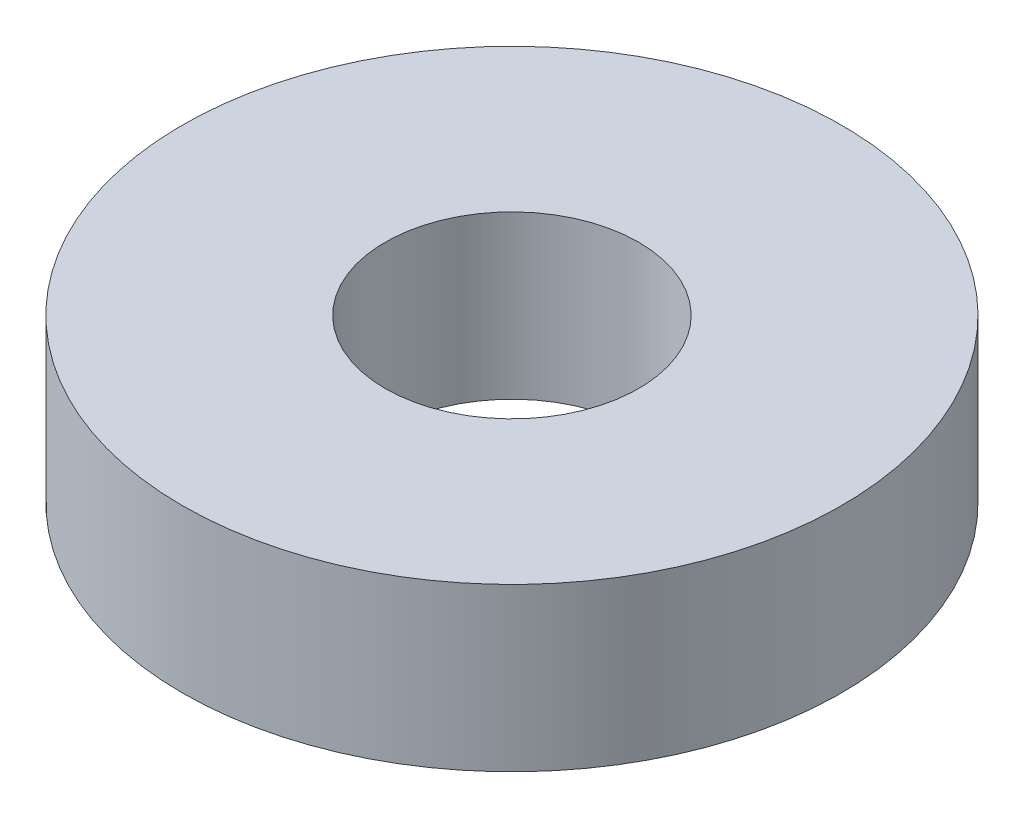
ISO-10303-21;
HEADER;
FILE_DESCRIPTION(('STEP AP214'),'2;1');
FILE_NAME('part.step','',(''),(''),'','','');
FILE_SCHEMA(('AUTOMOTIVE_DESIGN { 1 0 10303 214 1 1 1 1 }'));
ENDSEC;
DATA;
#1=APPLICATION_CONTEXT('core data for automotive mechanical design processes');
#2=APPLICATION_PROTOCOL_DEFINITION('international standard','automotive_design',2000,#1);
#3=PRODUCT_CONTEXT('',#1,'mechanical');
#4=PRODUCT('Part','Part','',(#3));
#5=PRODUCT_RELATED_PRODUCT_CATEGORY('part','',(#4));
#6=PRODUCT_DEFINITION_FORMATION('','',#4);
#7=PRODUCT_DEFINITION_CONTEXT('part definition',#1,'design');
#8=PRODUCT_DEFINITION('design','',#6,#7);
#9=PRODUCT_DEFINITION_SHAPE('','',#8);
#10=(LENGTH_UNIT() NAMED_UNIT(*) SI_UNIT(.MILLI.,.METRE.));
#11=(NAMED_UNIT(*) PLANE_ANGLE_UNIT() SI_UNIT($,.RADIAN.));
#12=(NAMED_UNIT(*) SI_UNIT($,.STERADIAN.) SOLID_ANGLE_UNIT());
#13=UNCERTAINTY_MEASURE_WITH_UNIT(LENGTH_MEASURE(1.E-05),#10,'distance_accuracy_value','');
#14=(GEOMETRIC_REPRESENTATION_CONTEXT(3) GLOBAL_UNCERTAINTY_ASSIGNED_CONTEXT((#13)) GLOBAL_UNIT_ASSIGNED_CONTEXT((#10,
#11,#12)) REPRESENTATION_CONTEXT('',''));
#15=CARTESIAN_POINT('',(0.,0.,0.));
#16=DIRECTION('',(0.,0.,1.));
#17=DIRECTION('',(1.,0.,0.));
#18=AXIS2_PLACEMENT_3D('',#15,#16,#17);
#19=CARTESIAN_POINT('',(0.,16.,0.));
#20=DIRECTION('',(0.,-1.,0.));
#21=DIRECTION('',(0.,0.,-1.));
#22=AXIS2_PLACEMENT_3D('',#19,#20,#21);
#23=CYLINDRICAL_SURFACE('',#22,32.5);
#24=CARTESIAN_POINT('',(0.,16.,0.));
#25=DIRECTION('',(0.,1.,0.));
#26=DIRECTION('',(0.,0.,1.));
#27=AXIS2_PLACEMENT_3D('',#24,#25,#26);
#28=CIRCLE('',#27,32.5);
#29=CARTESIAN_POINT('',(0.,16.,32.5));
#30=VERTEX_POINT('',#29);
#31=EDGE_CURVE('E10',#30,#30,#28,.T.);
#32=ORIENTED_EDGE('',*,*,#31,.F.);
#33=EDGE_LOOP('',(#32));
#34=FACE_BOUND('',#33,.T.);
#35=CARTESIAN_POINT('',(0.,0.,0.));
#36=DIRECTION('',(0.,1.,0.));
#37=DIRECTION('',(0.,0.,1.));
#38=AXIS2_PLACEMENT_3D('',#35,#36,#37);
#39=CIRCLE('',#38,32.5);
#40=CARTESIAN_POINT('',(0.,0.,32.5));
#41=VERTEX_POINT('',#40);
#42=EDGE_CURVE('E37',#41,#41,#39,.T.);
#43=ORIENTED_EDGE('',*,*,#42,.T.);
#44=EDGE_LOOP('',(#43));
#45=FACE_BOUND('',#44,.T.);
#46=ADVANCED_FACE('F40',(#34,#45),#23,.T.);
#47=CARTESIAN_POINT('',(0.,16.,0.));
#48=DIRECTION('',(0.,1.,0.));
#49=DIRECTION('',(0.,0.,1.));
#50=AXIS2_PLACEMENT_3D('',#47,#48,#49);
#51=PLANE('',#50);
#52=CARTESIAN_POINT('',(0.,16.,0.));
#53=DIRECTION('',(0.,1.,0.));
#54=DIRECTION('',(0.,0.,1.));
#55=AXIS2_PLACEMENT_3D('',#52,#53,#54);
#56=CIRCLE('',#55,12.5);
#57=CARTESIAN_POINT('',(0.,16.,12.5));
#58=VERTEX_POINT('',#57);
#59=EDGE_CURVE('E50',#58,#58,#56,.T.);
#60=ORIENTED_EDGE('',*,*,#59,.F.);
#61=EDGE_LOOP('',(#60));
#62=FACE_BOUND('',#61,.T.);
#63=ORIENTED_EDGE('',*,*,#31,.T.);
#64=EDGE_LOOP('',(#63));
#65=FACE_BOUND('',#64,.T.);
#66=ADVANCED_FACE('F59',(#62,#65),#51,.T.);
#67=CARTESIAN_POINT('',(0.,0.,0.));
#68=DIRECTION('',(0.,1.,0.));
#69=DIRECTION('',(0.,0.,1.));
#70=AXIS2_PLACEMENT_3D('',#67,#68,#69);
#71=PLANE('',#70);
#72=CARTESIAN_POINT('',(0.,0.,0.));
#73=DIRECTION('',(0.,1.,0.));
#74=DIRECTION('',(0.,0.,1.));
#75=AXIS2_PLACEMENT_3D('',#72,#73,#74);
#76=CIRCLE('',#75,12.5);
#77=CARTESIAN_POINT('',(0.,0.,12.5));
#78=VERTEX_POINT('',#77);
#79=EDGE_CURVE('E47',#78,#78,#76,.T.);
#80=ORIENTED_EDGE('',*,*,#79,.T.);
#81=EDGE_LOOP('',(#80));
#82=FACE_BOUND('',#81,.T.);
#83=ORIENTED_EDGE('',*,*,#42,.F.);
#84=EDGE_LOOP('',(#83));
#85=FACE_BOUND('',#84,.T.);
#86=ADVANCED_FACE('F58',(#82,#85),#71,.F.);
#87=CARTESIAN_POINT('',(0.,16.,0.));
#88=DIRECTION('',(0.,-1.,0.));
#89=DIRECTION('',(0.,0.,-1.));
#90=AXIS2_PLACEMENT_3D('',#87,#88,#89);
#91=CYLINDRICAL_SURFACE('',#90,12.5);
#92=ORIENTED_EDGE('',*,*,#59,.T.);
#93=EDGE_LOOP('',(#92));
#94=FACE_BOUND('',#93,.T.);
#95=ORIENTED_EDGE('',*,*,#79,.F.);
#96=EDGE_LOOP('',(#95));
#97=FACE_BOUND('',#96,.T.);
#98=ADVANCED_FACE('F54',(#94,#97),#91,.F.);
#99=CLOSED_SHELL('',(#46,#66,#86,#98));
#100=MANIFOLD_SOLID_BREP('B2',#99);
#101=ADVANCED_BREP_SHAPE_REPRESENTATION('',(#18,#100),#14);
#102=SHAPE_DEFINITION_REPRESENTATION(#9,#101);
ENDSEC;
END-ISO-10303-21;
